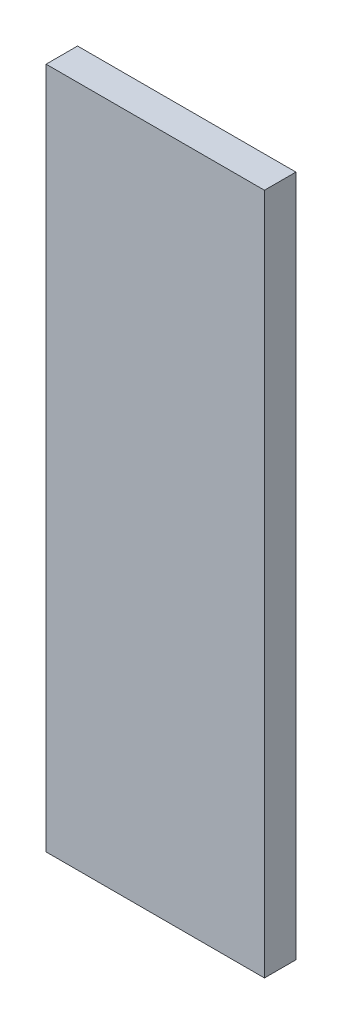
ISO-10303-21;
HEADER;
FILE_DESCRIPTION(('STEP AP214'),'2;1');
FILE_NAME('part.step','',(''),(''),'','','');
FILE_SCHEMA(('AUTOMOTIVE_DESIGN { 1 0 10303 214 1 1 1 1 }'));
ENDSEC;
DATA;
#1=APPLICATION_CONTEXT('core data for automotive mechanical design processes');
#2=APPLICATION_PROTOCOL_DEFINITION('international standard','automotive_design',2000,#1);
#3=PRODUCT_CONTEXT('',#1,'mechanical');
#4=PRODUCT('Part','Part','',(#3));
#5=PRODUCT_RELATED_PRODUCT_CATEGORY('part','',(#4));
#6=PRODUCT_DEFINITION_FORMATION('','',#4);
#7=PRODUCT_DEFINITION_CONTEXT('part definition',#1,'design');
#8=PRODUCT_DEFINITION('design','',#6,#7);
#9=PRODUCT_DEFINITION_SHAPE('','',#8);
#10=(LENGTH_UNIT() NAMED_UNIT(*) SI_UNIT(.MILLI.,.METRE.));
#11=(NAMED_UNIT(*) PLANE_ANGLE_UNIT() SI_UNIT($,.RADIAN.));
#12=(NAMED_UNIT(*) SI_UNIT($,.STERADIAN.) SOLID_ANGLE_UNIT());
#13=UNCERTAINTY_MEASURE_WITH_UNIT(LENGTH_MEASURE(1.E-05),#10,'distance_accuracy_value','');
#14=(GEOMETRIC_REPRESENTATION_CONTEXT(3) GLOBAL_UNCERTAINTY_ASSIGNED_CONTEXT((#13)) GLOBAL_UNIT_ASSIGNED_CONTEXT((#10,
#11,#12)) REPRESENTATION_CONTEXT('',''));
#15=CARTESIAN_POINT('',(0.,0.,0.));
#16=DIRECTION('',(0.,0.,1.));
#17=DIRECTION('',(1.,0.,0.));
#18=AXIS2_PLACEMENT_3D('',#15,#16,#17);
#19=CARTESIAN_POINT('',(0.62500002,1.9527647,0.17999964));
#20=DIRECTION('',(0.,0.,1.));
#21=DIRECTION('',(1.,0.,0.));
#22=AXIS2_PLACEMENT_3D('',#19,#20,#21);
#23=PLANE('',#22);
#24=DIRECTION('',(1.,0.,0.));
#25=VECTOR('',#24,1.);
#26=CARTESIAN_POINT('',(-0.62500002,1.9527647,0.17999964));
#27=LINE('',#26,#25);
#28=CARTESIAN_POINT('',(-0.62500002,1.9527647,0.17999964));
#29=VERTEX_POINT('',#28);
#30=CARTESIAN_POINT('',(0.62500002,1.9527647,0.17999964));
#31=VERTEX_POINT('',#30);
#32=EDGE_CURVE('E27',#29,#31,#27,.T.);
#33=ORIENTED_EDGE('',*,*,#32,.F.);
#34=DIRECTION('',(0.,1.,0.));
#35=VECTOR('',#34,1.);
#36=CARTESIAN_POINT('',(-0.62500002,-1.95276216,0.17999964));
#37=LINE('',#36,#35);
#38=CARTESIAN_POINT('',(-0.62500002,-1.95276216,0.17999964));
#39=VERTEX_POINT('',#38);
#40=EDGE_CURVE('E65',#39,#29,#37,.T.);
#41=ORIENTED_EDGE('',*,*,#40,.F.);
#42=DIRECTION('',(-1.,0.,0.));
#43=VECTOR('',#42,1.);
#44=CARTESIAN_POINT('',(0.62500002,-1.95276216,0.17999964));
#45=LINE('',#44,#43);
#46=CARTESIAN_POINT('',(0.62500002,-1.95276216,0.17999964));
#47=VERTEX_POINT('',#46);
#48=EDGE_CURVE('E91',#47,#39,#45,.T.);
#49=ORIENTED_EDGE('',*,*,#48,.F.);
#50=DIRECTION('',(0.,-1.,0.));
#51=VECTOR('',#50,1.);
#52=CARTESIAN_POINT('',(0.62500002,1.9527647,0.17999964));
#53=LINE('',#52,#51);
#54=EDGE_CURVE('E20',#31,#47,#53,.T.);
#55=ORIENTED_EDGE('',*,*,#54,.F.);
#56=EDGE_LOOP('',(#33,#41,#49,#55));
#57=FACE_BOUND('',#56,.T.);
#58=ADVANCED_FACE('F16',(#57),#23,.T.);
#59=CARTESIAN_POINT('',(0.62500002,1.9527647,0.));
#60=DIRECTION('',(0.,0.,1.));
#61=DIRECTION('',(1.,0.,0.));
#62=AXIS2_PLACEMENT_3D('',#59,#60,#61);
#63=PLANE('',#62);
#64=DIRECTION('',(0.,-1.,0.));
#65=VECTOR('',#64,1.);
#66=CARTESIAN_POINT('',(0.62500002,1.9527647,0.));
#67=LINE('',#66,#65);
#68=CARTESIAN_POINT('',(0.62500002,1.9527647,0.));
#69=VERTEX_POINT('',#68);
#70=CARTESIAN_POINT('',(0.62500002,-1.95276216,0.));
#71=VERTEX_POINT('',#70);
#72=EDGE_CURVE('E85',#69,#71,#67,.T.);
#73=ORIENTED_EDGE('',*,*,#72,.T.);
#74=DIRECTION('',(-1.,0.,0.));
#75=VECTOR('',#74,1.);
#76=CARTESIAN_POINT('',(0.62500002,-1.95276216,0.));
#77=LINE('',#76,#75);
#78=CARTESIAN_POINT('',(-0.62500002,-1.95276216,0.));
#79=VERTEX_POINT('',#78);
#80=EDGE_CURVE('E83',#71,#79,#77,.T.);
#81=ORIENTED_EDGE('',*,*,#80,.T.);
#82=DIRECTION('',(0.,1.,0.));
#83=VECTOR('',#82,1.);
#84=CARTESIAN_POINT('',(-0.62500002,-1.95276216,0.));
#85=LINE('',#84,#83);
#86=CARTESIAN_POINT('',(-0.62500002,1.9527647,0.));
#87=VERTEX_POINT('',#86);
#88=EDGE_CURVE('E72',#79,#87,#85,.T.);
#89=ORIENTED_EDGE('',*,*,#88,.T.);
#90=DIRECTION('',(1.,0.,0.));
#91=VECTOR('',#90,1.);
#92=CARTESIAN_POINT('',(-0.62500002,1.9527647,0.));
#93=LINE('',#92,#91);
#94=EDGE_CURVE('E10',#87,#69,#93,.T.);
#95=ORIENTED_EDGE('',*,*,#94,.T.);
#96=EDGE_LOOP('',(#73,#81,#89,#95));
#97=FACE_BOUND('',#96,.T.);
#98=ADVANCED_FACE('F18',(#97),#63,.F.);
#99=CARTESIAN_POINT('',(-0.62500002,1.9527647,0.));
#100=DIRECTION('',(0.,1.,0.));
#101=DIRECTION('',(1.,0.,0.));
#102=AXIS2_PLACEMENT_3D('',#99,#100,#101);
#103=PLANE('',#102);
#104=DIRECTION('',(0.,0.,1.));
#105=VECTOR('',#104,1.);
#106=CARTESIAN_POINT('',(-0.62500002,1.9527647,0.));
#107=LINE('',#106,#105);
#108=EDGE_CURVE('E78',#87,#29,#107,.T.);
#109=ORIENTED_EDGE('',*,*,#108,.T.);
#110=ORIENTED_EDGE('',*,*,#32,.T.);
#111=DIRECTION('',(0.,0.,1.));
#112=VECTOR('',#111,1.);
#113=CARTESIAN_POINT('',(0.62500002,1.9527647,0.));
#114=LINE('',#113,#112);
#115=EDGE_CURVE('E107',#69,#31,#114,.T.);
#116=ORIENTED_EDGE('',*,*,#115,.F.);
#117=ORIENTED_EDGE('',*,*,#94,.F.);
#118=EDGE_LOOP('',(#109,#110,#116,#117));
#119=FACE_BOUND('',#118,.T.);
#120=ADVANCED_FACE('F123',(#119),#103,.T.);
#121=CARTESIAN_POINT('',(-0.62500002,-1.95276216,0.));
#122=DIRECTION('',(-1.,0.,0.));
#123=DIRECTION('',(0.,0.,1.));
#124=AXIS2_PLACEMENT_3D('',#121,#122,#123);
#125=PLANE('',#124);
#126=DIRECTION('',(0.,0.,1.));
#127=VECTOR('',#126,1.);
#128=CARTESIAN_POINT('',(-0.62500002,-1.95276216,0.));
#129=LINE('',#128,#127);
#130=EDGE_CURVE('E76',#79,#39,#129,.T.);
#131=ORIENTED_EDGE('',*,*,#130,.T.);
#132=ORIENTED_EDGE('',*,*,#40,.T.);
#133=ORIENTED_EDGE('',*,*,#108,.F.);
#134=ORIENTED_EDGE('',*,*,#88,.F.);
#135=EDGE_LOOP('',(#131,#132,#133,#134));
#136=FACE_BOUND('',#135,.T.);
#137=ADVANCED_FACE('F74',(#136),#125,.T.);
#138=CARTESIAN_POINT('',(0.62500002,-1.95276216,0.));
#139=DIRECTION('',(0.,-1.,0.));
#140=DIRECTION('',(0.,0.,-1.));
#141=AXIS2_PLACEMENT_3D('',#138,#139,#140);
#142=PLANE('',#141);
#143=DIRECTION('',(0.,0.,1.));
#144=VECTOR('',#143,1.);
#145=CARTESIAN_POINT('',(0.62500002,-1.95276216,0.));
#146=LINE('',#145,#144);
#147=EDGE_CURVE('E101',#71,#47,#146,.T.);
#148=ORIENTED_EDGE('',*,*,#147,.T.);
#149=ORIENTED_EDGE('',*,*,#48,.T.);
#150=ORIENTED_EDGE('',*,*,#130,.F.);
#151=ORIENTED_EDGE('',*,*,#80,.F.);
#152=EDGE_LOOP('',(#148,#149,#150,#151));
#153=FACE_BOUND('',#152,.T.);
#154=ADVANCED_FACE('F90',(#153),#142,.T.);
#155=CARTESIAN_POINT('',(0.62500002,1.9527647,0.));
#156=DIRECTION('',(1.,0.,0.));
#157=DIRECTION('',(0.,1.,0.));
#158=AXIS2_PLACEMENT_3D('',#155,#156,#157);
#159=PLANE('',#158);
#160=ORIENTED_EDGE('',*,*,#115,.T.);
#161=ORIENTED_EDGE('',*,*,#54,.T.);
#162=ORIENTED_EDGE('',*,*,#147,.F.);
#163=ORIENTED_EDGE('',*,*,#72,.F.);
#164=EDGE_LOOP('',(#160,#161,#162,#163));
#165=FACE_BOUND('',#164,.T.);
#166=ADVANCED_FACE('F122',(#165),#159,.T.);
#167=CLOSED_SHELL('',(#58,#98,#120,#137,#154,#166));
#168=MANIFOLD_SOLID_BREP('B1',#167);
#169=ADVANCED_BREP_SHAPE_REPRESENTATION('',(#18,#168),#14);
#170=SHAPE_DEFINITION_REPRESENTATION(#9,#169);
ENDSEC;
END-ISO-10303-21;
